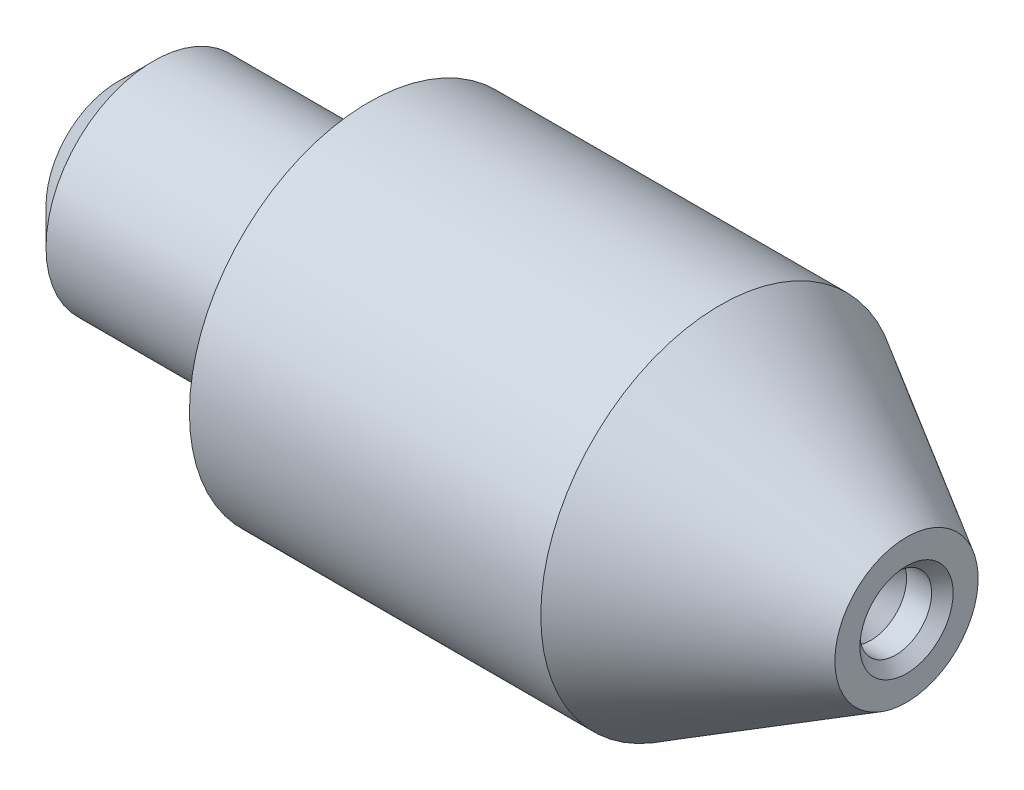
ISO-10303-21;
HEADER;
FILE_DESCRIPTION(('STEP AP214'),'2;1');
FILE_NAME('part.step','',(''),(''),'','','');
FILE_SCHEMA(('AUTOMOTIVE_DESIGN { 1 0 10303 214 1 1 1 1 }'));
ENDSEC;
DATA;
#1=APPLICATION_CONTEXT('core data for automotive mechanical design processes');
#2=APPLICATION_PROTOCOL_DEFINITION('international standard','automotive_design',2000,#1);
#3=PRODUCT_CONTEXT('',#1,'mechanical');
#4=PRODUCT('Part','Part','',(#3));
#5=PRODUCT_RELATED_PRODUCT_CATEGORY('part','',(#4));
#6=PRODUCT_DEFINITION_FORMATION('','',#4);
#7=PRODUCT_DEFINITION_CONTEXT('part definition',#1,'design');
#8=PRODUCT_DEFINITION('design','',#6,#7);
#9=PRODUCT_DEFINITION_SHAPE('','',#8);
#10=(LENGTH_UNIT() NAMED_UNIT(*) SI_UNIT(.MILLI.,.METRE.));
#11=(NAMED_UNIT(*) PLANE_ANGLE_UNIT() SI_UNIT($,.RADIAN.));
#12=(NAMED_UNIT(*) SI_UNIT($,.STERADIAN.) SOLID_ANGLE_UNIT());
#13=UNCERTAINTY_MEASURE_WITH_UNIT(LENGTH_MEASURE(1.E-05),#10,'distance_accuracy_value','');
#14=(GEOMETRIC_REPRESENTATION_CONTEXT(3) GLOBAL_UNCERTAINTY_ASSIGNED_CONTEXT((#13)) GLOBAL_UNIT_ASSIGNED_CONTEXT((#10,
#11,#12)) REPRESENTATION_CONTEXT('',''));
#15=CARTESIAN_POINT('',(0.,0.,0.));
#16=DIRECTION('',(0.,0.,1.));
#17=DIRECTION('',(1.,0.,0.));
#18=AXIS2_PLACEMENT_3D('',#15,#16,#17);
#19=CARTESIAN_POINT('',(-7.,0.,0.));
#20=DIRECTION('',(1.,0.,0.));
#21=DIRECTION('',(0.,0.,-1.));
#22=AXIS2_PLACEMENT_3D('',#19,#20,#21);
#23=PLANE('',#22);
#24=CARTESIAN_POINT('',(-7.,0.,0.));
#25=DIRECTION('',(-1.,0.,0.));
#26=DIRECTION('',(0.,0.,1.));
#27=AXIS2_PLACEMENT_3D('',#24,#25,#26);
#28=CIRCLE('',#27,2.);
#29=CARTESIAN_POINT('',(-7.,0.,2.));
#30=VERTEX_POINT('',#29);
#31=EDGE_CURVE('E43',#30,#30,#28,.T.);
#32=ORIENTED_EDGE('',*,*,#31,.T.);
#33=EDGE_LOOP('',(#32));
#34=FACE_BOUND('',#33,.T.);
#35=ADVANCED_FACE('F36',(#34),#23,.F.);
#36=CARTESIAN_POINT('',(-6.,0.,0.));
#37=DIRECTION('',(1.,0.,0.));
#38=DIRECTION('',(0.,0.,-1.));
#39=AXIS2_PLACEMENT_3D('',#36,#37,#38);
#40=CONICAL_SURFACE('',#39,3.,0.785398163397448);
#41=ORIENTED_EDGE('',*,*,#31,.F.);
#42=EDGE_LOOP('',(#41));
#43=FACE_BOUND('',#42,.T.);
#44=CARTESIAN_POINT('',(-6.,0.,0.));
#45=DIRECTION('',(-1.,0.,0.));
#46=DIRECTION('',(0.,0.,1.));
#47=AXIS2_PLACEMENT_3D('',#44,#45,#46);
#48=CIRCLE('',#47,3.);
#49=CARTESIAN_POINT('',(-6.,0.,3.));
#50=VERTEX_POINT('',#49);
#51=EDGE_CURVE('E72',#50,#50,#48,.T.);
#52=ORIENTED_EDGE('',*,*,#51,.T.);
#53=EDGE_LOOP('',(#52));
#54=FACE_BOUND('',#53,.T.);
#55=ADVANCED_FACE('F78',(#43,#54),#40,.T.);
#56=CARTESIAN_POINT('',(-2.84526558891274,0.,0.));
#57=DIRECTION('',(-1.,0.,0.));
#58=DIRECTION('',(0.,0.,1.));
#59=AXIS2_PLACEMENT_3D('',#56,#57,#58);
#60=CYLINDRICAL_SURFACE('',#59,3.);
#61=ORIENTED_EDGE('',*,*,#51,.F.);
#62=EDGE_LOOP('',(#61));
#63=FACE_BOUND('',#62,.T.);
#64=CARTESIAN_POINT('',(0.,0.,0.));
#65=DIRECTION('',(-1.,0.,0.));
#66=DIRECTION('',(0.,0.,1.));
#67=AXIS2_PLACEMENT_3D('',#64,#65,#66);
#68=CIRCLE('',#67,3.);
#69=CARTESIAN_POINT('',(0.,0.,3.));
#70=VERTEX_POINT('',#69);
#71=EDGE_CURVE('E69',#70,#70,#68,.T.);
#72=ORIENTED_EDGE('',*,*,#71,.T.);
#73=EDGE_LOOP('',(#72));
#74=FACE_BOUND('',#73,.T.);
#75=ADVANCED_FACE('F81',(#63,#74),#60,.T.);
#76=CARTESIAN_POINT('',(0.,0.,-3.));
#77=DIRECTION('',(1.,0.,0.));
#78=DIRECTION('',(0.,0.,-1.));
#79=AXIS2_PLACEMENT_3D('',#76,#77,#78);
#80=PLANE('',#79);
#81=ORIENTED_EDGE('',*,*,#71,.F.);
#82=EDGE_LOOP('',(#81));
#83=FACE_BOUND('',#82,.T.);
#84=CARTESIAN_POINT('',(0.,0.,0.));
#85=DIRECTION('',(-1.,0.,0.));
#86=DIRECTION('',(0.,0.,1.));
#87=AXIS2_PLACEMENT_3D('',#84,#85,#86);
#88=CIRCLE('',#87,5.);
#89=CARTESIAN_POINT('',(0.,0.,5.));
#90=VERTEX_POINT('',#89);
#91=EDGE_CURVE('E66',#90,#90,#88,.T.);
#92=ORIENTED_EDGE('',*,*,#91,.T.);
#93=EDGE_LOOP('',(#92));
#94=FACE_BOUND('',#93,.T.);
#95=ADVANCED_FACE('F87',(#83,#94),#80,.F.);
#96=CARTESIAN_POINT('',(-2.84526558891274,0.,0.));
#97=DIRECTION('',(-1.,0.,0.));
#98=DIRECTION('',(0.,0.,1.));
#99=AXIS2_PLACEMENT_3D('',#96,#97,#98);
#100=CYLINDRICAL_SURFACE('',#99,5.);
#101=ORIENTED_EDGE('',*,*,#91,.F.);
#102=EDGE_LOOP('',(#101));
#103=FACE_BOUND('',#102,.T.);
#104=CARTESIAN_POINT('',(9.8,0.,0.));
#105=DIRECTION('',(-1.,0.,0.));
#106=DIRECTION('',(0.,0.,1.));
#107=AXIS2_PLACEMENT_3D('',#104,#105,#106);
#108=CIRCLE('',#107,5.);
#109=CARTESIAN_POINT('',(9.8,0.,5.));
#110=VERTEX_POINT('',#109);
#111=EDGE_CURVE('E63',#110,#110,#108,.T.);
#112=ORIENTED_EDGE('',*,*,#111,.T.);
#113=EDGE_LOOP('',(#112));
#114=FACE_BOUND('',#113,.T.);
#115=ADVANCED_FACE('F93',(#103,#114),#100,.T.);
#116=CARTESIAN_POINT('',(15.,0.,0.));
#117=DIRECTION('',(-1.,0.,0.));
#118=DIRECTION('',(0.,0.,1.));
#119=AXIS2_PLACEMENT_3D('',#116,#117,#118);
#120=CONICAL_SURFACE('',#119,1.99777860021394,0.5235987755983);
#121=ORIENTED_EDGE('',*,*,#111,.F.);
#122=EDGE_LOOP('',(#121));
#123=FACE_BOUND('',#122,.T.);
#124=CARTESIAN_POINT('',(15.,0.,0.));
#125=DIRECTION('',(-1.,0.,0.));
#126=DIRECTION('',(0.,0.,1.));
#127=AXIS2_PLACEMENT_3D('',#124,#125,#126);
#128=CIRCLE('',#127,1.99777860021394);
#129=CARTESIAN_POINT('',(15.,0.,1.99777860021394));
#130=VERTEX_POINT('',#129);
#131=EDGE_CURVE('E58',#130,#130,#128,.T.);
#132=ORIENTED_EDGE('',*,*,#131,.T.);
#133=EDGE_LOOP('',(#132));
#134=FACE_BOUND('',#133,.T.);
#135=ADVANCED_FACE('F99',(#123,#134),#120,.T.);
#136=CARTESIAN_POINT('',(15.,0.,-1.99777860021394));
#137=DIRECTION('',(-1.,0.,0.));
#138=DIRECTION('',(0.,0.,1.));
#139=AXIS2_PLACEMENT_3D('',#136,#137,#138);
#140=PLANE('',#139);
#141=CARTESIAN_POINT('',(15.,0.,0.));
#142=DIRECTION('',(-1.,0.,0.));
#143=DIRECTION('',(0.,0.,1.));
#144=AXIS2_PLACEMENT_3D('',#141,#142,#143);
#145=CIRCLE('',#144,1.30000000000001);
#146=CARTESIAN_POINT('',(15.,0.,1.30000000000001));
#147=VERTEX_POINT('',#146);
#148=EDGE_CURVE('E11',#147,#147,#145,.T.);
#149=ORIENTED_EDGE('',*,*,#148,.T.);
#150=EDGE_LOOP('',(#149));
#151=FACE_BOUND('',#150,.T.);
#152=ORIENTED_EDGE('',*,*,#131,.F.);
#153=EDGE_LOOP('',(#152));
#154=FACE_BOUND('',#153,.T.);
#155=ADVANCED_FACE('F105',(#151,#154),#140,.F.);
#156=CARTESIAN_POINT('',(14.7,0.,0.));
#157=DIRECTION('',(1.,0.,0.));
#158=DIRECTION('',(0.,0.,-1.));
#159=AXIS2_PLACEMENT_3D('',#156,#157,#158);
#160=CONICAL_SURFACE('',#159,1.,0.785398163397457);
#161=ORIENTED_EDGE('',*,*,#148,.F.);
#162=EDGE_LOOP('',(#161));
#163=FACE_BOUND('',#162,.T.);
#164=CARTESIAN_POINT('',(14.7,0.,0.));
#165=DIRECTION('',(1.,0.,0.));
#166=DIRECTION('',(0.,0.,-1.));
#167=AXIS2_PLACEMENT_3D('',#164,#165,#166);
#168=CIRCLE('',#167,1.);
#169=CARTESIAN_POINT('',(14.7,0.,-1.));
#170=VERTEX_POINT('',#169);
#171=EDGE_CURVE('E55',#170,#170,#168,.T.);
#172=ORIENTED_EDGE('',*,*,#171,.F.);
#173=EDGE_LOOP('',(#172));
#174=FACE_BOUND('',#173,.T.);
#175=ADVANCED_FACE('F38',(#163,#174),#160,.F.);
#176=CARTESIAN_POINT('',(14.,0.,0.));
#177=DIRECTION('',(1.,0.,0.));
#178=DIRECTION('',(0.,0.,-1.));
#179=AXIS2_PLACEMENT_3D('',#176,#177,#178);
#180=CYLINDRICAL_SURFACE('',#179,1.);
#181=CARTESIAN_POINT('',(14.,0.,0.));
#182=DIRECTION('',(1.,0.,0.));
#183=DIRECTION('',(0.,0.,-1.));
#184=AXIS2_PLACEMENT_3D('',#181,#182,#183);
#185=CIRCLE('',#184,1.);
#186=CARTESIAN_POINT('',(14.,0.,-1.));
#187=VERTEX_POINT('',#186);
#188=EDGE_CURVE('E53',#187,#187,#185,.T.);
#189=ORIENTED_EDGE('',*,*,#188,.F.);
#190=EDGE_LOOP('',(#189));
#191=FACE_BOUND('',#190,.T.);
#192=ORIENTED_EDGE('',*,*,#171,.T.);
#193=EDGE_LOOP('',(#192));
#194=FACE_BOUND('',#193,.T.);
#195=ADVANCED_FACE('F49',(#191,#194),#180,.F.);
#196=CARTESIAN_POINT('',(14.,0.,0.));
#197=DIRECTION('',(1.,0.,0.));
#198=DIRECTION('',(0.,0.,-1.));
#199=AXIS2_PLACEMENT_3D('',#196,#197,#198);
#200=CONICAL_SURFACE('',#199,1.,0.78539816339745);
#201=CARTESIAN_POINT('',(13.,0.,0.));
#202=VERTEX_POINT('',#201);
#203=VERTEX_LOOP('',#202);
#204=FACE_BOUND('',#203,.T.);
#205=ORIENTED_EDGE('',*,*,#188,.T.);
#206=EDGE_LOOP('',(#205));
#207=FACE_BOUND('',#206,.T.);
#208=ADVANCED_FACE('F46',(#204,#207),#200,.F.);
#209=CLOSED_SHELL('',(#35,#55,#75,#95,#115,#135,#155,#175,#195,#208));
#210=MANIFOLD_SOLID_BREP('B2',#209);
#211=ADVANCED_BREP_SHAPE_REPRESENTATION('',(#18,#210),#14);
#212=SHAPE_DEFINITION_REPRESENTATION(#9,#211);
ENDSEC;
END-ISO-10303-21;
